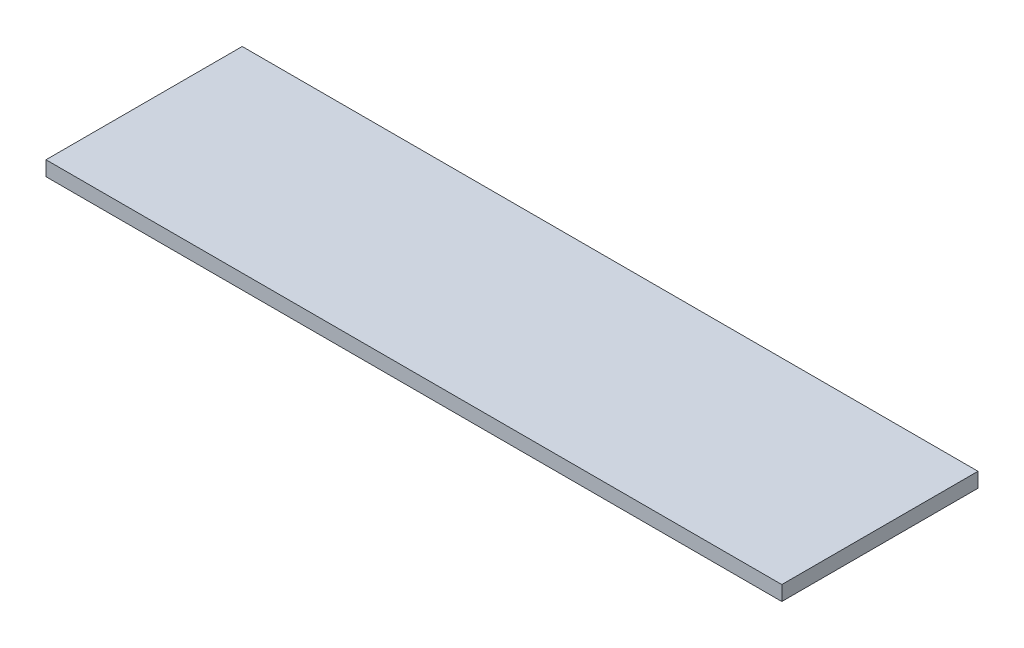
ISO-10303-21;
HEADER;
FILE_DESCRIPTION(('STEP AP214'),'2;1');
FILE_NAME('part.step','',(''),(''),'','','');
FILE_SCHEMA(('AUTOMOTIVE_DESIGN { 1 0 10303 214 1 1 1 1 }'));
ENDSEC;
DATA;
#1=APPLICATION_CONTEXT('core data for automotive mechanical design processes');
#2=APPLICATION_PROTOCOL_DEFINITION('international standard','automotive_design',2000,#1);
#3=PRODUCT_CONTEXT('',#1,'mechanical');
#4=PRODUCT('Part','Part','',(#3));
#5=PRODUCT_RELATED_PRODUCT_CATEGORY('part','',(#4));
#6=PRODUCT_DEFINITION_FORMATION('','',#4);
#7=PRODUCT_DEFINITION_CONTEXT('part definition',#1,'design');
#8=PRODUCT_DEFINITION('design','',#6,#7);
#9=PRODUCT_DEFINITION_SHAPE('','',#8);
#10=(LENGTH_UNIT() NAMED_UNIT(*) SI_UNIT(.MILLI.,.METRE.));
#11=(NAMED_UNIT(*) PLANE_ANGLE_UNIT() SI_UNIT($,.RADIAN.));
#12=(NAMED_UNIT(*) SI_UNIT($,.STERADIAN.) SOLID_ANGLE_UNIT());
#13=UNCERTAINTY_MEASURE_WITH_UNIT(LENGTH_MEASURE(1.E-05),#10,'distance_accuracy_value','');
#14=(GEOMETRIC_REPRESENTATION_CONTEXT(3) GLOBAL_UNCERTAINTY_ASSIGNED_CONTEXT((#13)) GLOBAL_UNIT_ASSIGNED_CONTEXT((#10,
#11,#12)) REPRESENTATION_CONTEXT('',''));
#15=CARTESIAN_POINT('',(0.,0.,0.));
#16=DIRECTION('',(0.,0.,1.));
#17=DIRECTION('',(1.,0.,0.));
#18=AXIS2_PLACEMENT_3D('',#15,#16,#17);
#19=CARTESIAN_POINT('',(-150.,-3.00000000000002,80.));
#20=DIRECTION('',(1.,0.,0.));
#21=DIRECTION('',(0.,0.,-1.));
#22=AXIS2_PLACEMENT_3D('',#19,#20,#21);
#23=PLANE('',#22);
#24=DIRECTION('',(0.,-1.,0.));
#25=VECTOR('',#24,1.);
#26=CARTESIAN_POINT('',(-150.,-3.00000000000002,0.));
#27=LINE('',#26,#25);
#28=CARTESIAN_POINT('',(-150.,2.99999999999998,0.));
#29=VERTEX_POINT('',#28);
#30=CARTESIAN_POINT('',(-150.,-3.00000000000002,0.));
#31=VERTEX_POINT('',#30);
#32=EDGE_CURVE('E103',#29,#31,#27,.T.);
#33=ORIENTED_EDGE('',*,*,#32,.T.);
#34=DIRECTION('',(0.,0.,-1.));
#35=VECTOR('',#34,1.);
#36=CARTESIAN_POINT('',(-150.,-3.00000000000002,80.));
#37=LINE('',#36,#35);
#38=CARTESIAN_POINT('',(-150.,-3.00000000000002,80.));
#39=VERTEX_POINT('',#38);
#40=EDGE_CURVE('E11',#39,#31,#37,.T.);
#41=ORIENTED_EDGE('',*,*,#40,.F.);
#42=DIRECTION('',(0.,-1.,0.));
#43=VECTOR('',#42,1.);
#44=CARTESIAN_POINT('',(-150.,-3.00000000000002,80.));
#45=LINE('',#44,#43);
#46=CARTESIAN_POINT('',(-150.,2.99999999999998,80.));
#47=VERTEX_POINT('',#46);
#48=EDGE_CURVE('E91',#47,#39,#45,.T.);
#49=ORIENTED_EDGE('',*,*,#48,.F.);
#50=DIRECTION('',(0.,0.,-1.));
#51=VECTOR('',#50,1.);
#52=CARTESIAN_POINT('',(-150.,2.99999999999998,80.));
#53=LINE('',#52,#51);
#54=EDGE_CURVE('E99',#47,#29,#53,.T.);
#55=ORIENTED_EDGE('',*,*,#54,.T.);
#56=EDGE_LOOP('',(#33,#41,#49,#55));
#57=FACE_BOUND('',#56,.T.);
#58=ADVANCED_FACE('F40',(#57),#23,.F.);
#59=CARTESIAN_POINT('',(150.,-2.99999999999998,80.));
#60=DIRECTION('',(0.,1.,0.));
#61=DIRECTION('',(-1.,0.,0.));
#62=AXIS2_PLACEMENT_3D('',#59,#60,#61);
#63=PLANE('',#62);
#64=DIRECTION('',(1.,0.,0.));
#65=VECTOR('',#64,1.);
#66=CARTESIAN_POINT('',(150.,-2.99999999999998,0.));
#67=LINE('',#66,#65);
#68=CARTESIAN_POINT('',(150.,-2.99999999999998,0.));
#69=VERTEX_POINT('',#68);
#70=EDGE_CURVE('E95',#31,#69,#67,.T.);
#71=ORIENTED_EDGE('',*,*,#70,.T.);
#72=DIRECTION('',(0.,0.,-1.));
#73=VECTOR('',#72,1.);
#74=CARTESIAN_POINT('',(150.,-2.99999999999998,80.));
#75=LINE('',#74,#73);
#76=CARTESIAN_POINT('',(150.,-2.99999999999998,80.));
#77=VERTEX_POINT('',#76);
#78=EDGE_CURVE('E48',#77,#69,#75,.T.);
#79=ORIENTED_EDGE('',*,*,#78,.F.);
#80=DIRECTION('',(1.,0.,0.));
#81=VECTOR('',#80,1.);
#82=CARTESIAN_POINT('',(150.,-2.99999999999998,80.));
#83=LINE('',#82,#81);
#84=EDGE_CURVE('E86',#39,#77,#83,.T.);
#85=ORIENTED_EDGE('',*,*,#84,.F.);
#86=ORIENTED_EDGE('',*,*,#40,.T.);
#87=EDGE_LOOP('',(#71,#79,#85,#86));
#88=FACE_BOUND('',#87,.T.);
#89=ADVANCED_FACE('F94',(#88),#63,.F.);
#90=CARTESIAN_POINT('',(150.,-2.99999999999998,80.));
#91=DIRECTION('',(-1.,0.,0.));
#92=DIRECTION('',(0.,0.,1.));
#93=AXIS2_PLACEMENT_3D('',#90,#91,#92);
#94=PLANE('',#93);
#95=DIRECTION('',(0.,1.,0.));
#96=VECTOR('',#95,1.);
#97=CARTESIAN_POINT('',(150.,-2.99999999999998,0.));
#98=LINE('',#97,#96);
#99=CARTESIAN_POINT('',(150.,3.00000000000002,0.));
#100=VERTEX_POINT('',#99);
#101=EDGE_CURVE('E73',#69,#100,#98,.T.);
#102=ORIENTED_EDGE('',*,*,#101,.T.);
#103=DIRECTION('',(0.,0.,-1.));
#104=VECTOR('',#103,1.);
#105=CARTESIAN_POINT('',(150.,3.00000000000002,80.));
#106=LINE('',#105,#104);
#107=CARTESIAN_POINT('',(150.,3.00000000000002,80.));
#108=VERTEX_POINT('',#107);
#109=EDGE_CURVE('E96',#108,#100,#106,.T.);
#110=ORIENTED_EDGE('',*,*,#109,.F.);
#111=DIRECTION('',(0.,1.,0.));
#112=VECTOR('',#111,1.);
#113=CARTESIAN_POINT('',(150.,-2.99999999999998,80.));
#114=LINE('',#113,#112);
#115=EDGE_CURVE('E89',#77,#108,#114,.T.);
#116=ORIENTED_EDGE('',*,*,#115,.F.);
#117=ORIENTED_EDGE('',*,*,#78,.T.);
#118=EDGE_LOOP('',(#102,#110,#116,#117));
#119=FACE_BOUND('',#118,.T.);
#120=ADVANCED_FACE('F97',(#119),#94,.F.);
#121=CARTESIAN_POINT('',(150.,3.00000000000002,80.));
#122=DIRECTION('',(0.,-1.,0.));
#123=DIRECTION('',(1.,0.,0.));
#124=AXIS2_PLACEMENT_3D('',#121,#122,#123);
#125=PLANE('',#124);
#126=DIRECTION('',(-1.,0.,0.));
#127=VECTOR('',#126,1.);
#128=CARTESIAN_POINT('',(150.,3.00000000000002,0.));
#129=LINE('',#128,#127);
#130=EDGE_CURVE('E79',#100,#29,#129,.T.);
#131=ORIENTED_EDGE('',*,*,#130,.T.);
#132=ORIENTED_EDGE('',*,*,#54,.F.);
#133=DIRECTION('',(-1.,0.,0.));
#134=VECTOR('',#133,1.);
#135=CARTESIAN_POINT('',(150.,3.00000000000002,80.));
#136=LINE('',#135,#134);
#137=EDGE_CURVE('E56',#108,#47,#136,.T.);
#138=ORIENTED_EDGE('',*,*,#137,.F.);
#139=ORIENTED_EDGE('',*,*,#109,.T.);
#140=EDGE_LOOP('',(#131,#132,#138,#139));
#141=FACE_BOUND('',#140,.T.);
#142=ADVANCED_FACE('F110',(#141),#125,.F.);
#143=CARTESIAN_POINT('',(0.,0.,80.));
#144=DIRECTION('',(0.,0.,1.));
#145=DIRECTION('',(1.,0.,0.));
#146=AXIS2_PLACEMENT_3D('',#143,#144,#145);
#147=PLANE('',#146);
#148=ORIENTED_EDGE('',*,*,#48,.T.);
#149=ORIENTED_EDGE('',*,*,#84,.T.);
#150=ORIENTED_EDGE('',*,*,#115,.T.);
#151=ORIENTED_EDGE('',*,*,#137,.T.);
#152=EDGE_LOOP('',(#148,#149,#150,#151));
#153=FACE_BOUND('',#152,.T.);
#154=ADVANCED_FACE('F87',(#153),#147,.T.);
#155=CARTESIAN_POINT('',(0.,0.,0.));
#156=DIRECTION('',(0.,0.,1.));
#157=DIRECTION('',(1.,0.,0.));
#158=AXIS2_PLACEMENT_3D('',#155,#156,#157);
#159=PLANE('',#158);
#160=ORIENTED_EDGE('',*,*,#32,.F.);
#161=ORIENTED_EDGE('',*,*,#130,.F.);
#162=ORIENTED_EDGE('',*,*,#101,.F.);
#163=ORIENTED_EDGE('',*,*,#70,.F.);
#164=EDGE_LOOP('',(#160,#161,#162,#163));
#165=FACE_BOUND('',#164,.T.);
#166=ADVANCED_FACE('F113',(#165),#159,.F.);
#167=CLOSED_SHELL('',(#58,#89,#120,#142,#154,#166));
#168=MANIFOLD_SOLID_BREP('B2',#167);
#169=ADVANCED_BREP_SHAPE_REPRESENTATION('',(#18,#168),#14);
#170=SHAPE_DEFINITION_REPRESENTATION(#9,#169);
ENDSEC;
END-ISO-10303-21;
